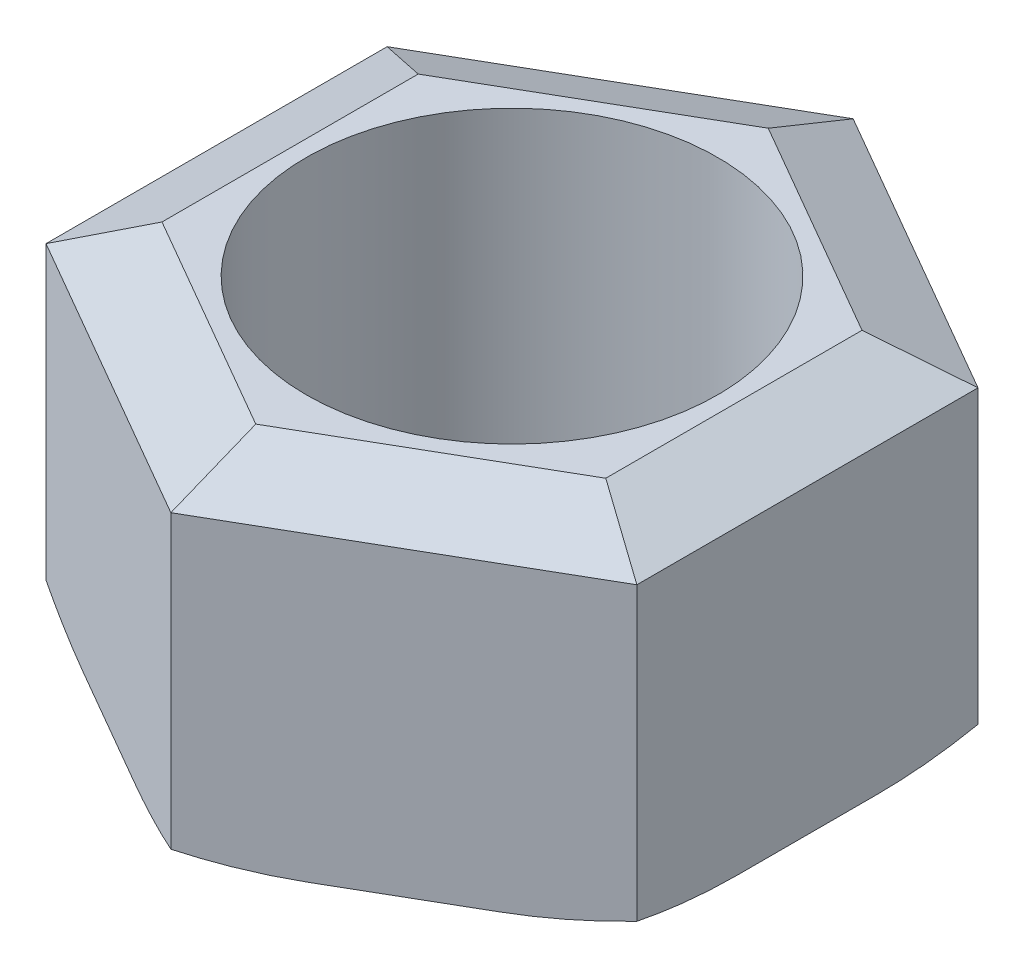
ISO-10303-21;
HEADER;
FILE_DESCRIPTION(('STEP AP214'),'2;1');
FILE_NAME('part.step','',(''),(''),'','','');
FILE_SCHEMA(('AUTOMOTIVE_DESIGN { 1 0 10303 214 1 1 1 1 }'));
ENDSEC;
DATA;
#1=APPLICATION_CONTEXT('core data for automotive mechanical design processes');
#2=APPLICATION_PROTOCOL_DEFINITION('international standard','automotive_design',2000,#1);
#3=PRODUCT_CONTEXT('',#1,'mechanical');
#4=PRODUCT('Part','Part','',(#3));
#5=PRODUCT_RELATED_PRODUCT_CATEGORY('part','',(#4));
#6=PRODUCT_DEFINITION_FORMATION('','',#4);
#7=PRODUCT_DEFINITION_CONTEXT('part definition',#1,'design');
#8=PRODUCT_DEFINITION('design','',#6,#7);
#9=PRODUCT_DEFINITION_SHAPE('','',#8);
#10=(LENGTH_UNIT() NAMED_UNIT(*) SI_UNIT(.MILLI.,.METRE.));
#11=(NAMED_UNIT(*) PLANE_ANGLE_UNIT() SI_UNIT($,.RADIAN.));
#12=(NAMED_UNIT(*) SI_UNIT($,.STERADIAN.) SOLID_ANGLE_UNIT());
#13=UNCERTAINTY_MEASURE_WITH_UNIT(LENGTH_MEASURE(1.E-05),#10,'distance_accuracy_value','');
#14=(GEOMETRIC_REPRESENTATION_CONTEXT(3) GLOBAL_UNCERTAINTY_ASSIGNED_CONTEXT((#13)) GLOBAL_UNIT_ASSIGNED_CONTEXT((#10,
#11,#12)) REPRESENTATION_CONTEXT('',''));
#15=CARTESIAN_POINT('',(0.,0.,0.));
#16=DIRECTION('',(0.,0.,1.));
#17=DIRECTION('',(1.,0.,0.));
#18=AXIS2_PLACEMENT_3D('',#15,#16,#17);
#19=CARTESIAN_POINT('',(0.,10.8,0.));
#20=DIRECTION('',(0.,1.,0.));
#21=DIRECTION('',(0.,0.,1.));
#22=AXIS2_PLACEMENT_3D('',#19,#20,#21);
#23=PLANE('',#22);
#24=DIRECTION('',(0.866025403784439,0.,-0.5));
#25=VECTOR('',#24,1.);
#26=CARTESIAN_POINT('',(7.54469930740038,10.8,3.11780252824718));
#27=LINE('',#26,#25);
#28=CARTESIAN_POINT('',(0.,10.8,7.47373670432958));
#29=VERTEX_POINT('',#28);
#30=CARTESIAN_POINT('',(6.47244584714561,10.8,3.73686835216479));
#31=VERTEX_POINT('',#30);
#32=EDGE_CURVE('E181',#29,#31,#27,.T.);
#33=ORIENTED_EDGE('',*,*,#32,.T.);
#34=DIRECTION('',(0.,0.,-1.));
#35=VECTOR('',#34,1.);
#36=CARTESIAN_POINT('',(6.47244584714561,10.8,-4.975));
#37=LINE('',#36,#35);
#38=CARTESIAN_POINT('',(6.47244584714561,10.8,-3.73686835216479));
#39=VERTEX_POINT('',#38);
#40=EDGE_CURVE('E214',#31,#39,#37,.T.);
#41=ORIENTED_EDGE('',*,*,#40,.T.);
#42=DIRECTION('',(-0.866025403784439,0.,-0.5));
#43=VECTOR('',#42,1.);
#44=CARTESIAN_POINT('',(-1.07225346025478,10.8,-8.09280252824719));
#45=LINE('',#44,#43);
#46=CARTESIAN_POINT('',(0.,10.8,-7.47373670432958));
#47=VERTEX_POINT('',#46);
#48=EDGE_CURVE('E212',#39,#47,#45,.T.);
#49=ORIENTED_EDGE('',*,*,#48,.T.);
#50=DIRECTION('',(-0.866025403784439,0.,0.5));
#51=VECTOR('',#50,1.);
#52=CARTESIAN_POINT('',(-7.54469930740038,10.8,-3.11780252824719));
#53=LINE('',#52,#51);
#54=CARTESIAN_POINT('',(-6.47244584714561,10.8,-3.73686835216479));
#55=VERTEX_POINT('',#54);
#56=EDGE_CURVE('E210',#47,#55,#53,.T.);
#57=ORIENTED_EDGE('',*,*,#56,.T.);
#58=DIRECTION('',(0.,0.,1.));
#59=VECTOR('',#58,1.);
#60=CARTESIAN_POINT('',(-6.47244584714561,10.8,4.975));
#61=LINE('',#60,#59);
#62=CARTESIAN_POINT('',(-6.47244584714561,10.8,3.73686835216479));
#63=VERTEX_POINT('',#62);
#64=EDGE_CURVE('E184',#55,#63,#61,.T.);
#65=ORIENTED_EDGE('',*,*,#64,.T.);
#66=DIRECTION('',(0.866025403784439,0.,0.5));
#67=VECTOR('',#66,1.);
#68=CARTESIAN_POINT('',(1.07225346025477,10.8,8.09280252824719));
#69=LINE('',#68,#67);
#70=EDGE_CURVE('E176',#63,#29,#69,.T.);
#71=ORIENTED_EDGE('',*,*,#70,.T.);
#72=EDGE_LOOP('',(#33,#41,#49,#57,#65,#71));
#73=FACE_BOUND('',#72,.T.);
#74=CARTESIAN_POINT('',(0.,10.8,0.));
#75=DIRECTION('',(0.,1.,0.));
#76=DIRECTION('',(0.,0.,1.));
#77=AXIS2_PLACEMENT_3D('',#74,#75,#76);
#78=CIRCLE('',#77,6.);
#79=CARTESIAN_POINT('',(0.,10.8,6.));
#80=VERTEX_POINT('',#79);
#81=EDGE_CURVE('E347',#80,#80,#78,.T.);
#82=ORIENTED_EDGE('',*,*,#81,.F.);
#83=EDGE_LOOP('',(#82));
#84=FACE_BOUND('',#83,.T.);
#85=ADVANCED_FACE('F34',(#73,#84),#23,.T.);
#86=CARTESIAN_POINT('',(0.,0.,0.));
#87=DIRECTION('',(0.,1.,0.));
#88=DIRECTION('',(0.,0.,1.));
#89=AXIS2_PLACEMENT_3D('',#86,#87,#88);
#90=PLANE('',#89);
#91=DIRECTION('',(0.866025403784439,0.,-0.5));
#92=VECTOR('',#91,1.);
#93=CARTESIAN_POINT('',(-3.23622292357281,0.,-5.60530252824719));
#94=LINE('',#93,#92);
#95=CARTESIAN_POINT('',(-3.9367362767014,0.,-5.20086095524748));
#96=VERTEX_POINT('',#95);
#97=CARTESIAN_POINT('',(-2.53570957044422,0.,-6.00974410124691));
#98=VERTEX_POINT('',#97);
#99=EDGE_CURVE('E256',#96,#98,#94,.T.);
#100=ORIENTED_EDGE('',*,*,#99,.T.);
#101=CARTESIAN_POINT('',(0.,0.,25.3133141994306));
#102=DIRECTION('',(0.,1.,0.));
#103=DIRECTION('',(0.,0.,1.));
#104=AXIS2_PLACEMENT_3D('',#101,#102,#103);
#105=ELLIPSE('',#104,32.0466957261706,12.);
#106=CARTESIAN_POINT('',(2.5357095704442,0.,-6.00974410124692));
#107=VERTEX_POINT('',#106);
#108=EDGE_CURVE('E289',#98,#107,#105,.F.);
#109=ORIENTED_EDGE('',*,*,#108,.T.);
#110=DIRECTION('',(0.866025403784439,0.,0.5));
#111=VECTOR('',#110,1.);
#112=CARTESIAN_POINT('',(3.23622292357281,0.,-5.60530252824719));
#113=LINE('',#112,#111);
#114=CARTESIAN_POINT('',(3.9367362767014,0.,-5.20086095524747));
#115=VERTEX_POINT('',#114);
#116=EDGE_CURVE('E253',#107,#115,#113,.T.);
#117=ORIENTED_EDGE('',*,*,#116,.T.);
#118=CARTESIAN_POINT('',(-21.9219731506842,0.,12.6566570997153));
#119=DIRECTION('',(0.,1.,0.));
#120=DIRECTION('',(-0.866025403784438,0.,0.500000000000001));
#121=AXIS2_PLACEMENT_3D('',#118,#119,#120);
#122=ELLIPSE('',#121,32.0466957261706,12.);
#123=CARTESIAN_POINT('',(6.47244584714561,0.,-0.808883145999448));
#124=VERTEX_POINT('',#123);
#125=EDGE_CURVE('E279',#115,#124,#122,.F.);
#126=ORIENTED_EDGE('',*,*,#125,.T.);
#127=DIRECTION('',(0.,0.,1.));
#128=VECTOR('',#127,1.);
#129=CARTESIAN_POINT('',(6.47244584714561,0.,0.));
#130=LINE('',#129,#128);
#131=CARTESIAN_POINT('',(6.47244584714561,0.,0.808883145999451));
#132=VERTEX_POINT('',#131);
#133=EDGE_CURVE('E250',#124,#132,#130,.T.);
#134=ORIENTED_EDGE('',*,*,#133,.T.);
#135=CARTESIAN_POINT('',(-21.9219731506842,0.,-12.6566570997153));
#136=DIRECTION('',(0.,1.,0.));
#137=DIRECTION('',(-0.866025403784439,0.,-0.5));
#138=AXIS2_PLACEMENT_3D('',#135,#136,#137);
#139=ELLIPSE('',#138,32.0466957261706,12.);
#140=CARTESIAN_POINT('',(3.93673627670139,0.,5.20086095524747));
#141=VERTEX_POINT('',#140);
#142=EDGE_CURVE('E281',#132,#141,#139,.F.);
#143=ORIENTED_EDGE('',*,*,#142,.T.);
#144=DIRECTION('',(-0.866025403784439,0.,0.5));
#145=VECTOR('',#144,1.);
#146=CARTESIAN_POINT('',(3.23622292357281,0.,5.60530252824719));
#147=LINE('',#146,#145);
#148=CARTESIAN_POINT('',(2.53570957044421,0.,6.00974410124691));
#149=VERTEX_POINT('',#148);
#150=EDGE_CURVE('E247',#141,#149,#147,.T.);
#151=ORIENTED_EDGE('',*,*,#150,.T.);
#152=CARTESIAN_POINT('',(0.,0.,-25.3133141994306));
#153=DIRECTION('',(0.,1.,0.));
#154=DIRECTION('',(0.,0.,1.));
#155=AXIS2_PLACEMENT_3D('',#152,#153,#154);
#156=ELLIPSE('',#155,32.0466957261706,12.);
#157=CARTESIAN_POINT('',(-2.53570957044421,0.,6.00974410124691));
#158=VERTEX_POINT('',#157);
#159=EDGE_CURVE('E283',#149,#158,#156,.F.);
#160=ORIENTED_EDGE('',*,*,#159,.T.);
#161=DIRECTION('',(-0.866025403784439,0.,-0.5));
#162=VECTOR('',#161,1.);
#163=CARTESIAN_POINT('',(-3.23622292357281,0.,5.60530252824719));
#164=LINE('',#163,#162);
#165=CARTESIAN_POINT('',(-3.9367362767014,0.,5.20086095524747));
#166=VERTEX_POINT('',#165);
#167=EDGE_CURVE('E244',#158,#166,#164,.T.);
#168=ORIENTED_EDGE('',*,*,#167,.T.);
#169=CARTESIAN_POINT('',(21.9219731506842,0.,-12.6566570997153));
#170=DIRECTION('',(0.,1.,0.));
#171=DIRECTION('',(-0.866025403784439,0.,0.499999999999999));
#172=AXIS2_PLACEMENT_3D('',#169,#170,#171);
#173=ELLIPSE('',#172,32.0466957261706,12.);
#174=CARTESIAN_POINT('',(-6.47244584714561,0.,0.808883145999452));
#175=VERTEX_POINT('',#174);
#176=EDGE_CURVE('E285',#166,#175,#173,.F.);
#177=ORIENTED_EDGE('',*,*,#176,.T.);
#178=DIRECTION('',(0.,0.,-1.));
#179=VECTOR('',#178,1.);
#180=CARTESIAN_POINT('',(-6.47244584714561,0.,0.));
#181=LINE('',#180,#179);
#182=CARTESIAN_POINT('',(-6.47244584714561,0.,-0.808883145999454));
#183=VERTEX_POINT('',#182);
#184=EDGE_CURVE('E241',#175,#183,#181,.T.);
#185=ORIENTED_EDGE('',*,*,#184,.T.);
#186=CARTESIAN_POINT('',(21.9219731506842,0.,12.6566570997153));
#187=DIRECTION('',(0.,1.,0.));
#188=DIRECTION('',(-0.866025403784439,0.,-0.5));
#189=AXIS2_PLACEMENT_3D('',#186,#187,#188);
#190=ELLIPSE('',#189,32.0466957261706,12.);
#191=EDGE_CURVE('E287',#183,#96,#190,.F.);
#192=ORIENTED_EDGE('',*,*,#191,.T.);
#193=EDGE_LOOP('',(#100,#109,#117,#126,#134,#143,#151,#160,#168,#177,#185,#192));
#194=FACE_BOUND('',#193,.T.);
#195=CARTESIAN_POINT('',(0.,0.,0.));
#196=DIRECTION('',(0.,1.,0.));
#197=DIRECTION('',(0.,0.,1.));
#198=AXIS2_PLACEMENT_3D('',#195,#196,#197);
#199=CIRCLE('',#198,6.);
#200=CARTESIAN_POINT('',(0.,0.,6.));
#201=VERTEX_POINT('',#200);
#202=EDGE_CURVE('E238',#201,#201,#199,.T.);
#203=ORIENTED_EDGE('',*,*,#202,.T.);
#204=EDGE_LOOP('',(#203));
#205=FACE_BOUND('',#204,.T.);
#206=ADVANCED_FACE('F355',(#194,#205),#90,.F.);
#207=CARTESIAN_POINT('',(8.61695276765516,10.8,-4.975));
#208=DIRECTION('',(-0.5,0.,0.866025403784439));
#209=DIRECTION('',(0.866025403784439,0.,0.5));
#210=AXIS2_PLACEMENT_3D('',#207,#208,#209);
#211=PLANE('',#210);
#212=DIRECTION('',(-0.866025403784439,0.,-0.5));
#213=VECTOR('',#212,1.);
#214=CARTESIAN_POINT('',(8.61695276765516,1.,-4.975));
#215=LINE('',#214,#213);
#216=CARTESIAN_POINT('',(6.08124319721095,1.,-6.43899260308268));
#217=VERTEX_POINT('',#216);
#218=CARTESIAN_POINT('',(2.5357095704442,1.,-8.48600739691733));
#219=VERTEX_POINT('',#218);
#220=EDGE_CURVE('E259',#217,#219,#215,.T.);
#221=ORIENTED_EDGE('',*,*,#220,.T.);
#222=CARTESIAN_POINT('',(0.,14.2405350275499,-9.94999999999999));
#223=DIRECTION('',(-0.5,0.,0.866025403784439));
#224=DIRECTION('',(0.67372464665114,-0.628325924442399,0.388975106103721));
#225=AXIS2_PLACEMENT_3D('',#222,#223,#224);
#226=ELLIPSE('',#225,14.9436196356765,12.);
#227=CARTESIAN_POINT('',(0.,1.29898079856211,-9.95));
#228=VERTEX_POINT('',#227);
#229=EDGE_CURVE('E298',#219,#228,#226,.F.);
#230=ORIENTED_EDGE('',*,*,#229,.T.);
#231=DIRECTION('',(0.,-1.,0.));
#232=VECTOR('',#231,1.);
#233=CARTESIAN_POINT('',(0.,10.8,-9.95));
#234=LINE('',#233,#232);
#235=CARTESIAN_POINT('',(0.,9.8,-9.95));
#236=VERTEX_POINT('',#235);
#237=EDGE_CURVE('E202',#236,#228,#234,.T.);
#238=ORIENTED_EDGE('',*,*,#237,.F.);
#239=DIRECTION('',(0.866025403784439,0.,0.5));
#240=VECTOR('',#239,1.);
#241=CARTESIAN_POINT('',(8.61695276765516,9.8,-4.975));
#242=LINE('',#241,#240);
#243=CARTESIAN_POINT('',(8.61695276765516,9.8,-4.975));
#244=VERTEX_POINT('',#243);
#245=EDGE_CURVE('E219',#236,#244,#242,.T.);
#246=ORIENTED_EDGE('',*,*,#245,.T.);
#247=DIRECTION('',(0.,-1.,0.));
#248=VECTOR('',#247,1.);
#249=CARTESIAN_POINT('',(8.61695276765516,10.8,-4.975));
#250=LINE('',#249,#248);
#251=CARTESIAN_POINT('',(8.61695276765516,1.29898079856211,-4.975));
#252=VERTEX_POINT('',#251);
#253=EDGE_CURVE('E337',#244,#252,#250,.T.);
#254=ORIENTED_EDGE('',*,*,#253,.T.);
#255=CARTESIAN_POINT('',(8.61695276765515,14.2405350275499,-4.975));
#256=DIRECTION('',(-0.5,0.,0.866025403784439));
#257=DIRECTION('',(-0.67372464665114,-0.628325924442399,-0.388975106103721));
#258=AXIS2_PLACEMENT_3D('',#255,#256,#257);
#259=ELLIPSE('',#258,14.9436196356765,12.);
#260=EDGE_CURVE('E296',#252,#217,#259,.F.);
#261=ORIENTED_EDGE('',*,*,#260,.T.);
#262=EDGE_LOOP('',(#221,#230,#238,#246,#254,#261));
#263=FACE_BOUND('',#262,.T.);
#264=ADVANCED_FACE('F342',(#263),#211,.F.);
#265=CARTESIAN_POINT('',(0.,10.8,-9.95));
#266=DIRECTION('',(0.5,0.,0.866025403784439));
#267=DIRECTION('',(0.866025403784439,0.,-0.5));
#268=AXIS2_PLACEMENT_3D('',#265,#266,#267);
#269=PLANE('',#268);
#270=ORIENTED_EDGE('',*,*,#237,.T.);
#271=CARTESIAN_POINT('',(0.,14.2405350275499,-9.95));
#272=DIRECTION('',(0.5,0.,0.866025403784439));
#273=DIRECTION('',(-0.673724646651141,-0.628325924442398,0.388975106103722));
#274=AXIS2_PLACEMENT_3D('',#271,#272,#273);
#275=ELLIPSE('',#274,14.9436196356765,12.);
#276=CARTESIAN_POINT('',(-2.53570957044421,1.,-8.48600739691732));
#277=VERTEX_POINT('',#276);
#278=EDGE_CURVE('E302',#228,#277,#275,.F.);
#279=ORIENTED_EDGE('',*,*,#278,.T.);
#280=DIRECTION('',(-0.866025403784439,0.,0.5));
#281=VECTOR('',#280,1.);
#282=CARTESIAN_POINT('',(0.,1.,-9.95));
#283=LINE('',#282,#281);
#284=CARTESIAN_POINT('',(-6.08124319721095,1.,-6.43899260308268));
#285=VERTEX_POINT('',#284);
#286=EDGE_CURVE('E228',#277,#285,#283,.T.);
#287=ORIENTED_EDGE('',*,*,#286,.T.);
#288=CARTESIAN_POINT('',(-8.61695276765516,14.2405350275499,-4.975));
#289=DIRECTION('',(0.5,0.,0.866025403784439));
#290=DIRECTION('',(-0.673724646651141,0.628325924442398,0.388975106103722));
#291=AXIS2_PLACEMENT_3D('',#288,#289,#290);
#292=ELLIPSE('',#291,14.9436196356765,12.);
#293=CARTESIAN_POINT('',(-8.61695276765516,1.29898079856212,-4.975));
#294=VERTEX_POINT('',#293);
#295=EDGE_CURVE('E300',#285,#294,#292,.F.);
#296=ORIENTED_EDGE('',*,*,#295,.T.);
#297=DIRECTION('',(0.,-1.,0.));
#298=VECTOR('',#297,1.);
#299=CARTESIAN_POINT('',(-8.61695276765516,10.8,-4.975));
#300=LINE('',#299,#298);
#301=CARTESIAN_POINT('',(-8.61695276765516,9.8,-4.975));
#302=VERTEX_POINT('',#301);
#303=EDGE_CURVE('E205',#302,#294,#300,.T.);
#304=ORIENTED_EDGE('',*,*,#303,.F.);
#305=DIRECTION('',(0.866025403784439,0.,-0.5));
#306=VECTOR('',#305,1.);
#307=CARTESIAN_POINT('',(0.,9.8,-9.95));
#308=LINE('',#307,#306);
#309=EDGE_CURVE('E221',#302,#236,#308,.T.);
#310=ORIENTED_EDGE('',*,*,#309,.T.);
#311=EDGE_LOOP('',(#270,#279,#287,#296,#304,#310));
#312=FACE_BOUND('',#311,.T.);
#313=ADVANCED_FACE('F368',(#312),#269,.F.);
#314=CARTESIAN_POINT('',(-8.61695276765516,10.8,-4.975));
#315=DIRECTION('',(1.,0.,0.));
#316=DIRECTION('',(0.,0.,-1.));
#317=AXIS2_PLACEMENT_3D('',#314,#315,#316);
#318=PLANE('',#317);
#319=ORIENTED_EDGE('',*,*,#303,.T.);
#320=CARTESIAN_POINT('',(-8.61695276765516,14.2405350275499,-4.975));
#321=DIRECTION('',(1.,0.,0.));
#322=DIRECTION('',(0.,0.628325924442399,-0.777950212207442));
#323=AXIS2_PLACEMENT_3D('',#320,#321,#322);
#324=ELLIPSE('',#323,14.9436196356765,12.);
#325=CARTESIAN_POINT('',(-8.61695276765516,1.,-2.04701479383466));
#326=VERTEX_POINT('',#325);
#327=EDGE_CURVE('E306',#294,#326,#324,.F.);
#328=ORIENTED_EDGE('',*,*,#327,.T.);
#329=DIRECTION('',(0.,0.,1.));
#330=VECTOR('',#329,1.);
#331=CARTESIAN_POINT('',(-8.61695276765516,1.,-4.975));
#332=LINE('',#331,#330);
#333=CARTESIAN_POINT('',(-8.61695276765516,1.,2.04701479383465));
#334=VERTEX_POINT('',#333);
#335=EDGE_CURVE('E270',#326,#334,#332,.T.);
#336=ORIENTED_EDGE('',*,*,#335,.T.);
#337=CARTESIAN_POINT('',(-8.61695276765516,14.2405350275499,4.975));
#338=DIRECTION('',(1.,0.,0.));
#339=DIRECTION('',(0.,0.628325924442399,0.777950212207443));
#340=AXIS2_PLACEMENT_3D('',#337,#338,#339);
#341=ELLIPSE('',#340,14.9436196356765,12.);
#342=CARTESIAN_POINT('',(-8.61695276765516,1.29898079856211,4.975));
#343=VERTEX_POINT('',#342);
#344=EDGE_CURVE('E304',#334,#343,#341,.F.);
#345=ORIENTED_EDGE('',*,*,#344,.T.);
#346=DIRECTION('',(0.,-1.,0.));
#347=VECTOR('',#346,1.);
#348=CARTESIAN_POINT('',(-8.61695276765516,10.8,4.975));
#349=LINE('',#348,#347);
#350=CARTESIAN_POINT('',(-8.61695276765516,9.8,4.975));
#351=VERTEX_POINT('',#350);
#352=EDGE_CURVE('E390',#351,#343,#349,.T.);
#353=ORIENTED_EDGE('',*,*,#352,.F.);
#354=DIRECTION('',(0.,0.,-1.));
#355=VECTOR('',#354,1.);
#356=CARTESIAN_POINT('',(-8.61695276765516,9.8,-4.975));
#357=LINE('',#356,#355);
#358=EDGE_CURVE('E223',#351,#302,#357,.T.);
#359=ORIENTED_EDGE('',*,*,#358,.T.);
#360=EDGE_LOOP('',(#319,#328,#336,#345,#353,#359));
#361=FACE_BOUND('',#360,.T.);
#362=ADVANCED_FACE('F397',(#361),#318,.F.);
#363=CARTESIAN_POINT('',(-8.61695276765516,10.8,4.975));
#364=DIRECTION('',(0.5,0.,-0.866025403784438));
#365=DIRECTION('',(-0.866025403784439,0.,-0.5));
#366=AXIS2_PLACEMENT_3D('',#363,#364,#365);
#367=PLANE('',#366);
#368=ORIENTED_EDGE('',*,*,#352,.T.);
#369=CARTESIAN_POINT('',(-8.61695276765516,14.2405350275499,4.975));
#370=DIRECTION('',(0.5,0.,-0.866025403784438));
#371=DIRECTION('',(-0.67372464665114,0.628325924442398,-0.388975106103722));
#372=AXIS2_PLACEMENT_3D('',#369,#370,#371);
#373=ELLIPSE('',#372,14.9436196356765,12.);
#374=CARTESIAN_POINT('',(-6.08124319721095,1.,6.43899260308268));
#375=VERTEX_POINT('',#374);
#376=EDGE_CURVE('E315',#343,#375,#373,.F.);
#377=ORIENTED_EDGE('',*,*,#376,.T.);
#378=DIRECTION('',(0.866025403784439,0.,0.5));
#379=VECTOR('',#378,1.);
#380=CARTESIAN_POINT('',(-8.61695276765516,1.,4.975));
#381=LINE('',#380,#379);
#382=CARTESIAN_POINT('',(-2.53570957044421,1.,8.48600739691732));
#383=VERTEX_POINT('',#382);
#384=EDGE_CURVE('E267',#375,#383,#381,.T.);
#385=ORIENTED_EDGE('',*,*,#384,.T.);
#386=CARTESIAN_POINT('',(0.,14.2405350275499,9.95));
#387=DIRECTION('',(0.5,0.,-0.866025403784438));
#388=DIRECTION('',(0.673724646651141,0.628325924442398,0.388975106103722));
#389=AXIS2_PLACEMENT_3D('',#386,#387,#388);
#390=ELLIPSE('',#389,14.9436196356765,12.);
#391=CARTESIAN_POINT('',(0.,1.29898079856212,9.95));
#392=VERTEX_POINT('',#391);
#393=EDGE_CURVE('E313',#383,#392,#390,.F.);
#394=ORIENTED_EDGE('',*,*,#393,.T.);
#395=DIRECTION('',(0.,-1.,0.));
#396=VECTOR('',#395,1.);
#397=CARTESIAN_POINT('',(0.,10.8,9.95));
#398=LINE('',#397,#396);
#399=CARTESIAN_POINT('',(0.,9.8,9.95));
#400=VERTEX_POINT('',#399);
#401=EDGE_CURVE('E388',#400,#392,#398,.T.);
#402=ORIENTED_EDGE('',*,*,#401,.F.);
#403=DIRECTION('',(-0.866025403784439,0.,-0.5));
#404=VECTOR('',#403,1.);
#405=CARTESIAN_POINT('',(-8.61695276765516,9.8,4.975));
#406=LINE('',#405,#404);
#407=EDGE_CURVE('E193',#400,#351,#406,.T.);
#408=ORIENTED_EDGE('',*,*,#407,.T.);
#409=EDGE_LOOP('',(#368,#377,#385,#394,#402,#408));
#410=FACE_BOUND('',#409,.T.);
#411=ADVANCED_FACE('F417',(#410),#367,.F.);
#412=CARTESIAN_POINT('',(0.,10.8,9.95));
#413=DIRECTION('',(-0.5,0.,-0.866025403784438));
#414=DIRECTION('',(-0.866025403784439,0.,0.5));
#415=AXIS2_PLACEMENT_3D('',#412,#413,#414);
#416=PLANE('',#415);
#417=ORIENTED_EDGE('',*,*,#401,.T.);
#418=CARTESIAN_POINT('',(0.,14.2405350275499,9.94999999999999));
#419=DIRECTION('',(-0.5,0.,-0.866025403784438));
#420=DIRECTION('',(-0.67372464665114,0.628325924442399,0.388975106103721));
#421=AXIS2_PLACEMENT_3D('',#418,#419,#420);
#422=ELLIPSE('',#421,14.9436196356765,12.);
#423=CARTESIAN_POINT('',(2.53570957044421,1.,8.48600739691732));
#424=VERTEX_POINT('',#423);
#425=EDGE_CURVE('E324',#392,#424,#422,.F.);
#426=ORIENTED_EDGE('',*,*,#425,.T.);
#427=DIRECTION('',(0.866025403784439,0.,-0.5));
#428=VECTOR('',#427,1.);
#429=CARTESIAN_POINT('',(0.,1.,9.95));
#430=LINE('',#429,#428);
#431=CARTESIAN_POINT('',(6.08124319721095,1.,6.43899260308267));
#432=VERTEX_POINT('',#431);
#433=EDGE_CURVE('E264',#424,#432,#430,.T.);
#434=ORIENTED_EDGE('',*,*,#433,.T.);
#435=CARTESIAN_POINT('',(8.61695276765515,14.2405350275499,4.975));
#436=DIRECTION('',(-0.5,0.,-0.866025403784438));
#437=DIRECTION('',(-0.673724646651141,-0.628325924442398,0.388975106103722));
#438=AXIS2_PLACEMENT_3D('',#435,#436,#437);
#439=ELLIPSE('',#438,14.9436196356765,12.);
#440=CARTESIAN_POINT('',(8.61695276765516,1.29898079856212,4.97499999999999));
#441=VERTEX_POINT('',#440);
#442=EDGE_CURVE('E322',#432,#441,#439,.F.);
#443=ORIENTED_EDGE('',*,*,#442,.T.);
#444=DIRECTION('',(0.,-1.,0.));
#445=VECTOR('',#444,1.);
#446=CARTESIAN_POINT('',(8.61695276765516,10.8,4.97499999999999));
#447=LINE('',#446,#445);
#448=CARTESIAN_POINT('',(8.61695276765516,9.8,4.97499999999999));
#449=VERTEX_POINT('',#448);
#450=EDGE_CURVE('E346',#449,#441,#447,.T.);
#451=ORIENTED_EDGE('',*,*,#450,.F.);
#452=DIRECTION('',(-0.866025403784439,0.,0.5));
#453=VECTOR('',#452,1.);
#454=CARTESIAN_POINT('',(0.,9.8,9.95));
#455=LINE('',#454,#453);
#456=EDGE_CURVE('E226',#449,#400,#455,.T.);
#457=ORIENTED_EDGE('',*,*,#456,.T.);
#458=EDGE_LOOP('',(#417,#426,#434,#443,#451,#457));
#459=FACE_BOUND('',#458,.T.);
#460=ADVANCED_FACE('F385',(#459),#416,.F.);
#461=CARTESIAN_POINT('',(8.61695276765516,10.8,4.97499999999999));
#462=DIRECTION('',(-1.,0.,0.));
#463=DIRECTION('',(0.,0.,1.));
#464=AXIS2_PLACEMENT_3D('',#461,#462,#463);
#465=PLANE('',#464);
#466=ORIENTED_EDGE('',*,*,#450,.T.);
#467=CARTESIAN_POINT('',(8.61695276765516,14.2405350275499,4.97500000000001));
#468=DIRECTION('',(-1.,0.,0.));
#469=DIRECTION('',(0.,-0.628325924442398,-0.777950212207443));
#470=AXIS2_PLACEMENT_3D('',#467,#468,#469);
#471=ELLIPSE('',#470,14.9436196356765,12.);
#472=CARTESIAN_POINT('',(8.61695276765516,1.,2.04701479383465));
#473=VERTEX_POINT('',#472);
#474=EDGE_CURVE('E11',#441,#473,#471,.F.);
#475=ORIENTED_EDGE('',*,*,#474,.T.);
#476=DIRECTION('',(0.,0.,-1.));
#477=VECTOR('',#476,1.);
#478=CARTESIAN_POINT('',(8.61695276765516,1.,4.97499999999999));
#479=LINE('',#478,#477);
#480=CARTESIAN_POINT('',(8.61695276765516,1.,-2.04701479383465));
#481=VERTEX_POINT('',#480);
#482=EDGE_CURVE('E262',#473,#481,#479,.T.);
#483=ORIENTED_EDGE('',*,*,#482,.T.);
#484=CARTESIAN_POINT('',(8.61695276765516,14.2405350275499,-4.97500000000001));
#485=DIRECTION('',(-1.,0.,0.));
#486=DIRECTION('',(0.,-0.628325924442398,0.777950212207443));
#487=AXIS2_PLACEMENT_3D('',#484,#485,#486);
#488=ELLIPSE('',#487,14.9436196356765,12.);
#489=EDGE_CURVE('E42',#481,#252,#488,.F.);
#490=ORIENTED_EDGE('',*,*,#489,.T.);
#491=ORIENTED_EDGE('',*,*,#253,.F.);
#492=DIRECTION('',(0.,0.,1.));
#493=VECTOR('',#492,1.);
#494=CARTESIAN_POINT('',(8.61695276765516,9.8,4.97499999999999));
#495=LINE('',#494,#493);
#496=EDGE_CURVE('E216',#244,#449,#495,.T.);
#497=ORIENTED_EDGE('',*,*,#496,.T.);
#498=EDGE_LOOP('',(#466,#475,#483,#490,#491,#497));
#499=FACE_BOUND('',#498,.T.);
#500=ADVANCED_FACE('F336',(#499),#465,.F.);
#501=CARTESIAN_POINT('',(0.,10.8,0.));
#502=DIRECTION('',(0.,-1.,0.));
#503=DIRECTION('',(0.,0.,-1.));
#504=AXIS2_PLACEMENT_3D('',#501,#502,#503);
#505=CYLINDRICAL_SURFACE('',#504,6.);
#506=ORIENTED_EDGE('',*,*,#81,.T.);
#507=EDGE_LOOP('',(#506));
#508=FACE_BOUND('',#507,.T.);
#509=ORIENTED_EDGE('',*,*,#202,.F.);
#510=EDGE_LOOP('',(#509));
#511=FACE_BOUND('',#510,.T.);
#512=ADVANCED_FACE('F451',(#508,#511),#505,.F.);
#513=CARTESIAN_POINT('',(-6.47244584714561,10.8,0.));
#514=DIRECTION('',(-0.4226182617407,0.906307787036649,0.));
#515=DIRECTION('',(0.,0.,-1.));
#516=AXIS2_PLACEMENT_3D('',#513,#514,#515);
#517=PLANE('',#516);
#518=DIRECTION('',(-0.803018297611853,-0.374453581814998,-0.463622830290399));
#519=VECTOR('',#518,1.);
#520=CARTESIAN_POINT('',(-5.08121866865098,11.4487398875654,-2.93364296615699));
#521=LINE('',#520,#519);
#522=EDGE_CURVE('E196',#302,#55,#521,.F.);
#523=ORIENTED_EDGE('',*,*,#522,.F.);
#524=ORIENTED_EDGE('',*,*,#358,.F.);
#525=DIRECTION('',(-0.803018297611854,-0.374453581814998,0.463622830290398));
#526=VECTOR('',#525,1.);
#527=CARTESIAN_POINT('',(-5.08121866865098,11.4487398875654,2.93364296615699));
#528=LINE('',#527,#526);
#529=EDGE_CURVE('E236',#63,#351,#528,.T.);
#530=ORIENTED_EDGE('',*,*,#529,.F.);
#531=ORIENTED_EDGE('',*,*,#64,.F.);
#532=EDGE_LOOP('',(#523,#524,#530,#531));
#533=FACE_BOUND('',#532,.T.);
#534=ADVANCED_FACE('F475',(#533),#517,.T.);
#535=CARTESIAN_POINT('',(-3.23622292357281,10.8,5.60530252824719));
#536=DIRECTION('',(-0.21130913087035,0.906307787036649,0.365998150770668));
#537=DIRECTION('',(-0.866025403784439,0.,-0.5));
#538=AXIS2_PLACEMENT_3D('',#535,#536,#537);
#539=PLANE('',#538);
#540=ORIENTED_EDGE('',*,*,#529,.T.);
#541=ORIENTED_EDGE('',*,*,#407,.F.);
#542=DIRECTION('',(0.,-0.374453581814998,0.927245660580797));
#543=VECTOR('',#542,1.);
#544=CARTESIAN_POINT('',(0.,11.4487398875654,5.86728593231399));
#545=LINE('',#544,#543);
#546=EDGE_CURVE('E191',#29,#400,#545,.T.);
#547=ORIENTED_EDGE('',*,*,#546,.F.);
#548=ORIENTED_EDGE('',*,*,#70,.F.);
#549=EDGE_LOOP('',(#540,#541,#547,#548));
#550=FACE_BOUND('',#549,.T.);
#551=ADVANCED_FACE('F192',(#550),#539,.T.);
#552=CARTESIAN_POINT('',(-3.2362229235728,10.8,-5.60530252824719));
#553=DIRECTION('',(-0.21130913087035,0.90630778703665,-0.365998150770667));
#554=DIRECTION('',(0.866025403784439,0.,-0.5));
#555=AXIS2_PLACEMENT_3D('',#552,#553,#554);
#556=PLANE('',#555);
#557=ORIENTED_EDGE('',*,*,#522,.T.);
#558=ORIENTED_EDGE('',*,*,#56,.F.);
#559=DIRECTION('',(0.,-0.374453581814998,-0.927245660580797));
#560=VECTOR('',#559,1.);
#561=CARTESIAN_POINT('',(0.,11.4487398875654,-5.86728593231399));
#562=LINE('',#561,#560);
#563=EDGE_CURVE('E197',#236,#47,#562,.F.);
#564=ORIENTED_EDGE('',*,*,#563,.F.);
#565=ORIENTED_EDGE('',*,*,#309,.F.);
#566=EDGE_LOOP('',(#557,#558,#564,#565));
#567=FACE_BOUND('',#566,.T.);
#568=ADVANCED_FACE('F375',(#567),#556,.T.);
#569=CARTESIAN_POINT('',(3.2362229235728,10.8,5.60530252824718));
#570=DIRECTION('',(0.21130913087035,0.90630778703665,0.365998150770667));
#571=DIRECTION('',(-0.866025403784439,0.,0.5));
#572=AXIS2_PLACEMENT_3D('',#569,#570,#571);
#573=PLANE('',#572);
#574=ORIENTED_EDGE('',*,*,#546,.T.);
#575=ORIENTED_EDGE('',*,*,#456,.F.);
#576=DIRECTION('',(-0.803018297611853,0.374453581814998,-0.463622830290399));
#577=VECTOR('',#576,1.);
#578=CARTESIAN_POINT('',(5.08121866865098,11.4487398875654,2.93364296615699));
#579=LINE('',#578,#577);
#580=EDGE_CURVE('E200',#31,#449,#579,.F.);
#581=ORIENTED_EDGE('',*,*,#580,.F.);
#582=ORIENTED_EDGE('',*,*,#32,.F.);
#583=EDGE_LOOP('',(#574,#575,#581,#582));
#584=FACE_BOUND('',#583,.T.);
#585=ADVANCED_FACE('F199',(#584),#573,.T.);
#586=CARTESIAN_POINT('',(3.2362229235728,10.8,-5.60530252824719));
#587=DIRECTION('',(0.21130913087035,0.90630778703665,-0.365998150770667));
#588=DIRECTION('',(0.866025403784439,0.,0.5));
#589=AXIS2_PLACEMENT_3D('',#586,#587,#588);
#590=PLANE('',#589);
#591=ORIENTED_EDGE('',*,*,#563,.T.);
#592=ORIENTED_EDGE('',*,*,#48,.F.);
#593=DIRECTION('',(0.803018297611853,-0.374453581814998,-0.463622830290399));
#594=VECTOR('',#593,1.);
#595=CARTESIAN_POINT('',(5.08121866865098,11.4487398875654,-2.93364296615699));
#596=LINE('',#595,#594);
#597=EDGE_CURVE('E229',#244,#39,#596,.F.);
#598=ORIENTED_EDGE('',*,*,#597,.F.);
#599=ORIENTED_EDGE('',*,*,#245,.F.);
#600=EDGE_LOOP('',(#591,#592,#598,#599));
#601=FACE_BOUND('',#600,.T.);
#602=ADVANCED_FACE('F379',(#601),#590,.T.);
#603=CARTESIAN_POINT('',(6.47244584714561,10.8,0.));
#604=DIRECTION('',(0.4226182617407,0.906307787036649,0.));
#605=DIRECTION('',(0.,0.,1.));
#606=AXIS2_PLACEMENT_3D('',#603,#604,#605);
#607=PLANE('',#606);
#608=ORIENTED_EDGE('',*,*,#580,.T.);
#609=ORIENTED_EDGE('',*,*,#496,.F.);
#610=ORIENTED_EDGE('',*,*,#597,.T.);
#611=ORIENTED_EDGE('',*,*,#40,.F.);
#612=EDGE_LOOP('',(#608,#609,#610,#611));
#613=FACE_BOUND('',#612,.T.);
#614=ADVANCED_FACE('F381',(#613),#607,.T.);
#615=CARTESIAN_POINT('',(0.,1.,9.95));
#616=DIRECTION('',(-0.211309130870351,0.906307787036649,-0.365998150770669));
#617=DIRECTION('',(0.866025403784439,0.,-0.5));
#618=AXIS2_PLACEMENT_3D('',#615,#616,#617);
#619=PLANE('',#618);
#620=ORIENTED_EDGE('',*,*,#433,.F.);
#621=DIRECTION('',(0.,-0.374453581814999,-0.927245660580797));
#622=VECTOR('',#621,1.);
#623=CARTESIAN_POINT('',(2.53570957044421,1.50831354343552,9.74472556721885));
#624=LINE('',#623,#622);
#625=EDGE_CURVE('E328',#424,#149,#624,.T.);
#626=ORIENTED_EDGE('',*,*,#625,.T.);
#627=ORIENTED_EDGE('',*,*,#150,.F.);
#628=DIRECTION('',(0.803018297611853,0.374453581814999,0.463622830290398));
#629=VECTOR('',#628,1.);
#630=CARTESIAN_POINT('',(3.46696383055498,-0.21905848922828,4.92963770700697));
#631=LINE('',#630,#629);
#632=EDGE_CURVE('E326',#141,#432,#631,.T.);
#633=ORIENTED_EDGE('',*,*,#632,.T.);
#634=EDGE_LOOP('',(#620,#626,#627,#633));
#635=FACE_BOUND('',#634,.T.);
#636=ADVANCED_FACE('F428',(#635),#619,.F.);
#637=CARTESIAN_POINT('',(8.61695276765516,1.,4.97499999999999));
#638=DIRECTION('',(-0.422618261740702,0.906307787036649,0.));
#639=DIRECTION('',(0.,0.,-1.));
#640=AXIS2_PLACEMENT_3D('',#637,#638,#639);
#641=PLANE('',#640);
#642=ORIENTED_EDGE('',*,*,#482,.F.);
#643=DIRECTION('',(0.803018297611853,0.374453581814999,0.463622830290398));
#644=VECTOR('',#643,1.);
#645=CARTESIAN_POINT('',(9.70703467934135,1.50831354343552,2.67637387898542));
#646=LINE('',#645,#644);
#647=EDGE_CURVE('E331',#473,#132,#646,.F.);
#648=ORIENTED_EDGE('',*,*,#647,.T.);
#649=ORIENTED_EDGE('',*,*,#133,.F.);
#650=DIRECTION('',(0.803018297611853,0.374453581814999,-0.463622830290399));
#651=VECTOR('',#650,1.);
#652=CARTESIAN_POINT('',(6.00267340099919,-0.219058489228282,-0.537659897758945));
#653=LINE('',#652,#651);
#654=EDGE_CURVE('E49',#124,#481,#653,.T.);
#655=ORIENTED_EDGE('',*,*,#654,.T.);
#656=EDGE_LOOP('',(#642,#648,#649,#655));
#657=FACE_BOUND('',#656,.T.);
#658=ADVANCED_FACE('F433',(#657),#641,.F.);
#659=CARTESIAN_POINT('',(-8.61695276765516,1.,4.975));
#660=DIRECTION('',(0.211309130870351,0.906307787036649,-0.365998150770669));
#661=DIRECTION('',(0.866025403784439,0.,0.5));
#662=AXIS2_PLACEMENT_3D('',#659,#660,#661);
#663=PLANE('',#662);
#664=ORIENTED_EDGE('',*,*,#384,.F.);
#665=DIRECTION('',(0.803018297611853,-0.374453581814999,-0.463622830290398));
#666=VECTOR('',#665,1.);
#667=CARTESIAN_POINT('',(-7.17132510889714,1.50831354343552,7.06835168823344));
#668=LINE('',#667,#666);
#669=EDGE_CURVE('E320',#375,#166,#668,.T.);
#670=ORIENTED_EDGE('',*,*,#669,.T.);
#671=ORIENTED_EDGE('',*,*,#167,.F.);
#672=DIRECTION('',(0.,-0.374453581814999,-0.927245660580796));
#673=VECTOR('',#672,1.);
#674=CARTESIAN_POINT('',(-2.53570957044422,-0.219058489228283,5.46729760476591));
#675=LINE('',#674,#673);
#676=EDGE_CURVE('E317',#158,#383,#675,.F.);
#677=ORIENTED_EDGE('',*,*,#676,.T.);
#678=EDGE_LOOP('',(#664,#670,#671,#677));
#679=FACE_BOUND('',#678,.T.);
#680=ADVANCED_FACE('F435',(#679),#663,.F.);
#681=CARTESIAN_POINT('',(8.61695276765516,1.,-4.975));
#682=DIRECTION('',(-0.211309130870351,0.906307787036649,0.365998150770668));
#683=DIRECTION('',(-0.866025403784439,0.,-0.5));
#684=AXIS2_PLACEMENT_3D('',#681,#682,#683);
#685=PLANE('',#684);
#686=ORIENTED_EDGE('',*,*,#116,.F.);
#687=DIRECTION('',(0.,0.374453581814999,-0.927245660580796));
#688=VECTOR('',#687,1.);
#689=CARTESIAN_POINT('',(2.5357095704442,-0.219058489228278,-5.46729760476592));
#690=LINE('',#689,#688);
#691=EDGE_CURVE('E294',#107,#219,#690,.T.);
#692=ORIENTED_EDGE('',*,*,#691,.T.);
#693=ORIENTED_EDGE('',*,*,#220,.F.);
#694=DIRECTION('',(0.803018297611853,0.374453581814999,-0.463622830290399));
#695=VECTOR('',#694,1.);
#696=CARTESIAN_POINT('',(7.17132510889714,1.50831354343552,-7.06835168823344));
#697=LINE('',#696,#695);
#698=EDGE_CURVE('E291',#217,#115,#697,.F.);
#699=ORIENTED_EDGE('',*,*,#698,.T.);
#700=EDGE_LOOP('',(#686,#692,#693,#699));
#701=FACE_BOUND('',#700,.T.);
#702=ADVANCED_FACE('F352',(#701),#685,.F.);
#703=CARTESIAN_POINT('',(-8.61695276765516,1.,-4.975));
#704=DIRECTION('',(0.422618261740702,0.906307787036649,0.));
#705=DIRECTION('',(0.,0.,1.));
#706=AXIS2_PLACEMENT_3D('',#703,#704,#705);
#707=PLANE('',#706);
#708=ORIENTED_EDGE('',*,*,#335,.F.);
#709=DIRECTION('',(0.803018297611853,-0.374453581814999,0.463622830290398));
#710=VECTOR('',#709,1.);
#711=CARTESIAN_POINT('',(-9.70703467934135,1.50831354343552,-2.67637387898542));
#712=LINE('',#711,#710);
#713=EDGE_CURVE('E311',#326,#183,#712,.T.);
#714=ORIENTED_EDGE('',*,*,#713,.T.);
#715=ORIENTED_EDGE('',*,*,#184,.F.);
#716=DIRECTION('',(0.803018297611853,-0.374453581814999,-0.463622830290398));
#717=VECTOR('',#716,1.);
#718=CARTESIAN_POINT('',(-6.0026734009992,-0.219058489228281,0.537659897758951));
#719=LINE('',#718,#717);
#720=EDGE_CURVE('E308',#175,#334,#719,.F.);
#721=ORIENTED_EDGE('',*,*,#720,.T.);
#722=EDGE_LOOP('',(#708,#714,#715,#721));
#723=FACE_BOUND('',#722,.T.);
#724=ADVANCED_FACE('F408',(#723),#707,.F.);
#725=CARTESIAN_POINT('',(0.,1.,-9.95));
#726=DIRECTION('',(0.211309130870351,0.906307787036649,0.365998150770669));
#727=DIRECTION('',(-0.866025403784439,0.,0.5));
#728=AXIS2_PLACEMENT_3D('',#725,#726,#727);
#729=PLANE('',#728);
#730=ORIENTED_EDGE('',*,*,#286,.F.);
#731=DIRECTION('',(0.,0.374453581814999,-0.927245660580796));
#732=VECTOR('',#731,1.);
#733=CARTESIAN_POINT('',(-2.53570957044421,1.50831354343552,-9.74472556721885));
#734=LINE('',#733,#732);
#735=EDGE_CURVE('E276',#277,#98,#734,.F.);
#736=ORIENTED_EDGE('',*,*,#735,.T.);
#737=ORIENTED_EDGE('',*,*,#99,.F.);
#738=DIRECTION('',(0.803018297611853,-0.374453581814999,0.463622830290398));
#739=VECTOR('',#738,1.);
#740=CARTESIAN_POINT('',(-3.46696383055498,-0.219058489228282,-4.92963770700697));
#741=LINE('',#740,#739);
#742=EDGE_CURVE('E273',#96,#285,#741,.F.);
#743=ORIENTED_EDGE('',*,*,#742,.T.);
#744=EDGE_LOOP('',(#730,#736,#737,#743));
#745=FACE_BOUND('',#744,.T.);
#746=ADVANCED_FACE('F365',(#745),#729,.F.);
#747=CARTESIAN_POINT('',(0.,12.3840069878753,-5.35274775797083));
#748=DIRECTION('',(0.,-0.374453581814999,0.927245660580796));
#749=DIRECTION('',(0.,-0.927245660580797,-0.374453581814999));
#750=AXIS2_PLACEMENT_3D('',#747,#748,#749);
#751=CYLINDRICAL_SURFACE('',#750,12.);
#752=ORIENTED_EDGE('',*,*,#229,.F.);
#753=ORIENTED_EDGE('',*,*,#691,.F.);
#754=ORIENTED_EDGE('',*,*,#108,.F.);
#755=ORIENTED_EDGE('',*,*,#735,.F.);
#756=ORIENTED_EDGE('',*,*,#278,.F.);
#757=EDGE_LOOP('',(#752,#753,#754,#755,#756));
#758=FACE_BOUND('',#757,.T.);
#759=ADVANCED_FACE('F361',(#758),#751,.T.);
#760=CARTESIAN_POINT('',(-0.931254260110768,10.6566349552115,-0.537659897758946));
#761=DIRECTION('',(-0.803018297611853,0.374453581814999,-0.463622830290398));
#762=DIRECTION('',(-0.5,0.,0.866025403784439));
#763=AXIS2_PLACEMENT_3D('',#760,#761,#762);
#764=CYLINDRICAL_SURFACE('',#763,12.);
#765=ORIENTED_EDGE('',*,*,#191,.F.);
#766=ORIENTED_EDGE('',*,*,#713,.F.);
#767=ORIENTED_EDGE('',*,*,#327,.F.);
#768=ORIENTED_EDGE('',*,*,#295,.F.);
#769=ORIENTED_EDGE('',*,*,#742,.F.);
#770=EDGE_LOOP('',(#765,#766,#767,#768,#769));
#771=FACE_BOUND('',#770,.T.);
#772=ADVANCED_FACE('F405',(#771),#764,.T.);
#773=CARTESIAN_POINT('',(-0.931254260110778,10.6566349552115,0.537659897758952));
#774=DIRECTION('',(-0.803018297611853,0.374453581814999,0.463622830290398));
#775=DIRECTION('',(0.499999999999999,0.,0.866025403784439));
#776=AXIS2_PLACEMENT_3D('',#773,#774,#775);
#777=CYLINDRICAL_SURFACE('',#776,12.);
#778=ORIENTED_EDGE('',*,*,#176,.F.);
#779=ORIENTED_EDGE('',*,*,#669,.F.);
#780=ORIENTED_EDGE('',*,*,#376,.F.);
#781=ORIENTED_EDGE('',*,*,#344,.F.);
#782=ORIENTED_EDGE('',*,*,#720,.F.);
#783=EDGE_LOOP('',(#778,#779,#780,#781,#782));
#784=FACE_BOUND('',#783,.T.);
#785=ADVANCED_FACE('F414',(#784),#777,.T.);
#786=CARTESIAN_POINT('',(0.,10.6566349552115,1.07531979551788));
#787=DIRECTION('',(0.,0.374453581814999,0.927245660580797));
#788=DIRECTION('',(0.,-0.927245660580797,0.374453581814999));
#789=AXIS2_PLACEMENT_3D('',#786,#787,#788);
#790=CYLINDRICAL_SURFACE('',#789,12.);
#791=ORIENTED_EDGE('',*,*,#159,.F.);
#792=ORIENTED_EDGE('',*,*,#625,.F.);
#793=ORIENTED_EDGE('',*,*,#425,.F.);
#794=ORIENTED_EDGE('',*,*,#393,.F.);
#795=ORIENTED_EDGE('',*,*,#676,.F.);
#796=EDGE_LOOP('',(#791,#792,#793,#794,#795));
#797=FACE_BOUND('',#796,.T.);
#798=ADVANCED_FACE('F424',(#797),#790,.T.);
#799=CARTESIAN_POINT('',(4.63561553845293,12.3840069878753,2.67637387898542));
#800=DIRECTION('',(-0.803018297611853,-0.374453581814999,-0.463622830290398));
#801=DIRECTION('',(-0.5,0.,0.866025403784439));
#802=AXIS2_PLACEMENT_3D('',#799,#800,#801);
#803=CYLINDRICAL_SURFACE('',#802,12.);
#804=ORIENTED_EDGE('',*,*,#442,.F.);
#805=ORIENTED_EDGE('',*,*,#632,.F.);
#806=ORIENTED_EDGE('',*,*,#142,.F.);
#807=ORIENTED_EDGE('',*,*,#647,.F.);
#808=ORIENTED_EDGE('',*,*,#474,.F.);
#809=EDGE_LOOP('',(#804,#805,#806,#807,#808));
#810=FACE_BOUND('',#809,.T.);
#811=ADVANCED_FACE('F432',(#810),#803,.T.);
#812=CARTESIAN_POINT('',(4.63561553845293,12.3840069878753,-2.67637387898542));
#813=DIRECTION('',(-0.803018297611852,-0.374453581814999,0.463622830290399));
#814=DIRECTION('',(0.500000000000001,0.,0.866025403784438));
#815=AXIS2_PLACEMENT_3D('',#812,#813,#814);
#816=CYLINDRICAL_SURFACE('',#815,12.);
#817=ORIENTED_EDGE('',*,*,#489,.F.);
#818=ORIENTED_EDGE('',*,*,#654,.F.);
#819=ORIENTED_EDGE('',*,*,#125,.F.);
#820=ORIENTED_EDGE('',*,*,#698,.F.);
#821=ORIENTED_EDGE('',*,*,#260,.F.);
#822=EDGE_LOOP('',(#817,#818,#819,#820,#821));
#823=FACE_BOUND('',#822,.T.);
#824=ADVANCED_FACE('F36',(#823),#816,.T.);
#825=CLOSED_SHELL('',(#85,#206,#264,#313,#362,#411,#460,#500,#512,#534,#551,#568,#585,#602,#614,
#636,#658,#680,#702,#724,#746,#759,#772,#785,#798,#811,#824));
#826=MANIFOLD_SOLID_BREP('B2',#825);
#827=ADVANCED_BREP_SHAPE_REPRESENTATION('',(#18,#826),#14);
#828=SHAPE_DEFINITION_REPRESENTATION(#9,#827);
ENDSEC;
END-ISO-10303-21;
